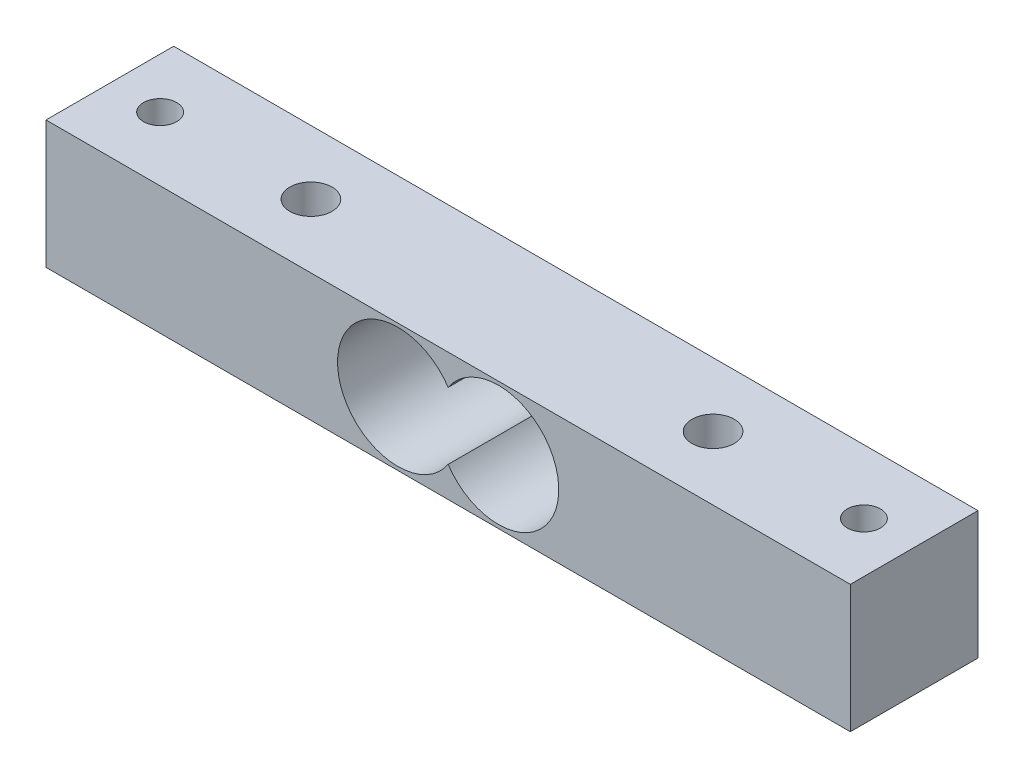
ISO-10303-21;
HEADER;
FILE_DESCRIPTION(('STEP AP214'),'2;1');
FILE_NAME('part.step','',(''),(''),'','','');
FILE_SCHEMA(('AUTOMOTIVE_DESIGN { 1 0 10303 214 1 1 1 1 }'));
ENDSEC;
DATA;
#1=APPLICATION_CONTEXT('core data for automotive mechanical design processes');
#2=APPLICATION_PROTOCOL_DEFINITION('international standard','automotive_design',2000,#1);
#3=PRODUCT_CONTEXT('',#1,'mechanical');
#4=PRODUCT('Part','Part','',(#3));
#5=PRODUCT_RELATED_PRODUCT_CATEGORY('part','',(#4));
#6=PRODUCT_DEFINITION_FORMATION('','',#4);
#7=PRODUCT_DEFINITION_CONTEXT('part definition',#1,'design');
#8=PRODUCT_DEFINITION('design','',#6,#7);
#9=PRODUCT_DEFINITION_SHAPE('','',#8);
#10=(LENGTH_UNIT() NAMED_UNIT(*) SI_UNIT(.MILLI.,.METRE.));
#11=(NAMED_UNIT(*) PLANE_ANGLE_UNIT() SI_UNIT($,.RADIAN.));
#12=(NAMED_UNIT(*) SI_UNIT($,.STERADIAN.) SOLID_ANGLE_UNIT());
#13=UNCERTAINTY_MEASURE_WITH_UNIT(LENGTH_MEASURE(1.E-05),#10,'distance_accuracy_value','');
#14=(GEOMETRIC_REPRESENTATION_CONTEXT(3) GLOBAL_UNCERTAINTY_ASSIGNED_CONTEXT((#13)) GLOBAL_UNIT_ASSIGNED_CONTEXT((#10,
#11,#12)) REPRESENTATION_CONTEXT('',''));
#15=CARTESIAN_POINT('',(0.,0.,0.));
#16=DIRECTION('',(0.,0.,1.));
#17=DIRECTION('',(1.,0.,0.));
#18=AXIS2_PLACEMENT_3D('',#15,#16,#17);
#19=CARTESIAN_POINT('',(0.,6.35,0.));
#20=DIRECTION('',(0.,-1.,0.));
#21=DIRECTION('',(0.,0.,-1.));
#22=AXIS2_PLACEMENT_3D('',#19,#20,#21);
#23=PLANE('',#22);
#24=CARTESIAN_POINT('',(-20.,6.35,0.));
#25=DIRECTION('',(0.,1.,0.));
#26=DIRECTION('',(0.,0.,1.));
#27=AXIS2_PLACEMENT_3D('',#24,#25,#26);
#28=CIRCLE('',#27,2.1);
#29=CARTESIAN_POINT('',(-20.,6.35,2.1));
#30=VERTEX_POINT('',#29);
#31=EDGE_CURVE('E273',#30,#30,#28,.T.);
#32=ORIENTED_EDGE('',*,*,#31,.F.);
#33=EDGE_LOOP('',(#32));
#34=FACE_BOUND('',#33,.T.);
#35=CARTESIAN_POINT('',(-35.,6.35,0.));
#36=DIRECTION('',(0.,1.,0.));
#37=DIRECTION('',(0.,0.,1.));
#38=AXIS2_PLACEMENT_3D('',#35,#36,#37);
#39=CIRCLE('',#38,1.65);
#40=CARTESIAN_POINT('',(-35.,6.35,1.64999999999999));
#41=VERTEX_POINT('',#40);
#42=EDGE_CURVE('E287',#41,#41,#39,.T.);
#43=ORIENTED_EDGE('',*,*,#42,.F.);
#44=EDGE_LOOP('',(#43));
#45=FACE_BOUND('',#44,.T.);
#46=DIRECTION('',(0.,0.,-1.));
#47=VECTOR('',#46,1.);
#48=CARTESIAN_POINT('',(40.,6.35,6.35));
#49=LINE('',#48,#47);
#50=CARTESIAN_POINT('',(40.,6.35,6.35));
#51=VERTEX_POINT('',#50);
#52=CARTESIAN_POINT('',(40.,6.35,-6.35));
#53=VERTEX_POINT('',#52);
#54=EDGE_CURVE('E108',#51,#53,#49,.T.);
#55=ORIENTED_EDGE('',*,*,#54,.T.);
#56=DIRECTION('',(-1.,0.,0.));
#57=VECTOR('',#56,1.);
#58=CARTESIAN_POINT('',(-40.,6.35,-6.35));
#59=LINE('',#58,#57);
#60=CARTESIAN_POINT('',(-40.,6.35,-6.35));
#61=VERTEX_POINT('',#60);
#62=EDGE_CURVE('E111',#53,#61,#59,.T.);
#63=ORIENTED_EDGE('',*,*,#62,.T.);
#64=DIRECTION('',(0.,0.,1.));
#65=VECTOR('',#64,1.);
#66=CARTESIAN_POINT('',(-40.,6.35,6.35));
#67=LINE('',#66,#65);
#68=CARTESIAN_POINT('',(-40.,6.35,6.35));
#69=VERTEX_POINT('',#68);
#70=EDGE_CURVE('E114',#61,#69,#67,.T.);
#71=ORIENTED_EDGE('',*,*,#70,.T.);
#72=DIRECTION('',(1.,0.,0.));
#73=VECTOR('',#72,1.);
#74=CARTESIAN_POINT('',(-40.,6.35,6.35));
#75=LINE('',#74,#73);
#76=EDGE_CURVE('E116',#69,#51,#75,.T.);
#77=ORIENTED_EDGE('',*,*,#76,.T.);
#78=EDGE_LOOP('',(#55,#63,#71,#77));
#79=FACE_BOUND('',#78,.T.);
#80=CARTESIAN_POINT('',(35.,6.35,0.));
#81=DIRECTION('',(0.,1.,0.));
#82=DIRECTION('',(0.,0.,1.));
#83=AXIS2_PLACEMENT_3D('',#80,#81,#82);
#84=CIRCLE('',#83,1.65);
#85=CARTESIAN_POINT('',(35.,6.35,1.64999999999999));
#86=VERTEX_POINT('',#85);
#87=EDGE_CURVE('E282',#86,#86,#84,.T.);
#88=ORIENTED_EDGE('',*,*,#87,.F.);
#89=EDGE_LOOP('',(#88));
#90=FACE_BOUND('',#89,.T.);
#91=CARTESIAN_POINT('',(20.,6.35,0.));
#92=DIRECTION('',(0.,1.,0.));
#93=DIRECTION('',(0.,0.,1.));
#94=AXIS2_PLACEMENT_3D('',#91,#92,#93);
#95=CIRCLE('',#94,2.1);
#96=CARTESIAN_POINT('',(20.,6.35,2.1));
#97=VERTEX_POINT('',#96);
#98=EDGE_CURVE('E269',#97,#97,#95,.T.);
#99=ORIENTED_EDGE('',*,*,#98,.F.);
#100=EDGE_LOOP('',(#99));
#101=FACE_BOUND('',#100,.T.);
#102=ADVANCED_FACE('F34',(#34,#45,#79,#90,#101),#23,.F.);
#103=CARTESIAN_POINT('',(40.,6.35,6.35));
#104=DIRECTION('',(-1.,0.,0.));
#105=DIRECTION('',(0.,0.,1.));
#106=AXIS2_PLACEMENT_3D('',#103,#104,#105);
#107=PLANE('',#106);
#108=DIRECTION('',(0.,0.,-1.));
#109=VECTOR('',#108,1.);
#110=CARTESIAN_POINT('',(40.,-6.35,6.35));
#111=LINE('',#110,#109);
#112=CARTESIAN_POINT('',(40.,-6.35,6.35));
#113=VERTEX_POINT('',#112);
#114=CARTESIAN_POINT('',(40.,-6.35,-6.35));
#115=VERTEX_POINT('',#114);
#116=EDGE_CURVE('E106',#113,#115,#111,.T.);
#117=ORIENTED_EDGE('',*,*,#116,.T.);
#118=DIRECTION('',(0.,-1.,0.));
#119=VECTOR('',#118,1.);
#120=CARTESIAN_POINT('',(40.,6.35,-6.35));
#121=LINE('',#120,#119);
#122=EDGE_CURVE('E11',#53,#115,#121,.T.);
#123=ORIENTED_EDGE('',*,*,#122,.F.);
#124=ORIENTED_EDGE('',*,*,#54,.F.);
#125=DIRECTION('',(0.,-1.,0.));
#126=VECTOR('',#125,1.);
#127=CARTESIAN_POINT('',(40.,6.35,6.35));
#128=LINE('',#127,#126);
#129=EDGE_CURVE('E118',#51,#113,#128,.T.);
#130=ORIENTED_EDGE('',*,*,#129,.T.);
#131=EDGE_LOOP('',(#117,#123,#124,#130));
#132=FACE_BOUND('',#131,.T.);
#133=ADVANCED_FACE('F36',(#132),#107,.F.);
#134=CARTESIAN_POINT('',(-40.,6.35,-6.35));
#135=DIRECTION('',(0.,0.,1.));
#136=DIRECTION('',(1.,0.,0.));
#137=AXIS2_PLACEMENT_3D('',#134,#135,#136);
#138=PLANE('',#137);
#139=CARTESIAN_POINT('',(5.,0.,-6.35));
#140=DIRECTION('',(0.,0.,1.));
#141=DIRECTION('',(1.,0.,0.));
#142=AXIS2_PLACEMENT_3D('',#139,#140,#141);
#143=CIRCLE('',#142,6.);
#144=CARTESIAN_POINT('',(0.,-3.3166247903554,-6.35));
#145=VERTEX_POINT('',#144);
#146=CARTESIAN_POINT('',(0.,3.3166247903554,-6.35));
#147=VERTEX_POINT('',#146);
#148=EDGE_CURVE('E90',#145,#147,#143,.T.);
#149=ORIENTED_EDGE('',*,*,#148,.T.);
#150=CARTESIAN_POINT('',(-5.,0.,-6.35));
#151=DIRECTION('',(0.,0.,1.));
#152=DIRECTION('',(1.,0.,0.));
#153=AXIS2_PLACEMENT_3D('',#150,#151,#152);
#154=CIRCLE('',#153,6.);
#155=EDGE_CURVE('E49',#147,#145,#154,.T.);
#156=ORIENTED_EDGE('',*,*,#155,.T.);
#157=EDGE_LOOP('',(#149,#156));
#158=FACE_BOUND('',#157,.T.);
#159=DIRECTION('',(-1.,0.,0.));
#160=VECTOR('',#159,1.);
#161=CARTESIAN_POINT('',(-40.,-6.35,-6.35));
#162=LINE('',#161,#160);
#163=CARTESIAN_POINT('',(-40.,-6.35,-6.35));
#164=VERTEX_POINT('',#163);
#165=EDGE_CURVE('E121',#115,#164,#162,.T.);
#166=ORIENTED_EDGE('',*,*,#165,.T.);
#167=DIRECTION('',(0.,-1.,0.));
#168=VECTOR('',#167,1.);
#169=CARTESIAN_POINT('',(-40.,6.35,-6.35));
#170=LINE('',#169,#168);
#171=EDGE_CURVE('E42',#61,#164,#170,.T.);
#172=ORIENTED_EDGE('',*,*,#171,.F.);
#173=ORIENTED_EDGE('',*,*,#62,.F.);
#174=ORIENTED_EDGE('',*,*,#122,.T.);
#175=EDGE_LOOP('',(#166,#172,#173,#174));
#176=FACE_BOUND('',#175,.T.);
#177=ADVANCED_FACE('F96',(#158,#176),#138,.F.);
#178=CARTESIAN_POINT('',(-40.,6.35,6.35));
#179=DIRECTION('',(1.,0.,0.));
#180=DIRECTION('',(0.,0.,-1.));
#181=AXIS2_PLACEMENT_3D('',#178,#179,#180);
#182=PLANE('',#181);
#183=DIRECTION('',(0.,0.,1.));
#184=VECTOR('',#183,1.);
#185=CARTESIAN_POINT('',(-40.,-6.35,6.35));
#186=LINE('',#185,#184);
#187=CARTESIAN_POINT('',(-40.,-6.35,6.35));
#188=VERTEX_POINT('',#187);
#189=EDGE_CURVE('E123',#164,#188,#186,.T.);
#190=ORIENTED_EDGE('',*,*,#189,.T.);
#191=DIRECTION('',(0.,-1.,0.));
#192=VECTOR('',#191,1.);
#193=CARTESIAN_POINT('',(-40.,6.35,6.35));
#194=LINE('',#193,#192);
#195=EDGE_CURVE('E128',#69,#188,#194,.T.);
#196=ORIENTED_EDGE('',*,*,#195,.F.);
#197=ORIENTED_EDGE('',*,*,#70,.F.);
#198=ORIENTED_EDGE('',*,*,#171,.T.);
#199=EDGE_LOOP('',(#190,#196,#197,#198));
#200=FACE_BOUND('',#199,.T.);
#201=ADVANCED_FACE('F135',(#200),#182,.F.);
#202=CARTESIAN_POINT('',(-40.,6.35,6.35));
#203=DIRECTION('',(0.,0.,-1.));
#204=DIRECTION('',(-1.,0.,0.));
#205=AXIS2_PLACEMENT_3D('',#202,#203,#204);
#206=PLANE('',#205);
#207=CARTESIAN_POINT('',(5.,0.,6.35));
#208=DIRECTION('',(0.,0.,1.));
#209=DIRECTION('',(1.,0.,0.));
#210=AXIS2_PLACEMENT_3D('',#207,#208,#209);
#211=CIRCLE('',#210,6.);
#212=CARTESIAN_POINT('',(0.,-3.3166247903554,6.35));
#213=VERTEX_POINT('',#212);
#214=CARTESIAN_POINT('',(0.,3.3166247903554,6.35));
#215=VERTEX_POINT('',#214);
#216=EDGE_CURVE('E98',#213,#215,#211,.T.);
#217=ORIENTED_EDGE('',*,*,#216,.F.);
#218=CARTESIAN_POINT('',(-5.,0.,6.35));
#219=DIRECTION('',(0.,0.,1.));
#220=DIRECTION('',(1.,0.,0.));
#221=AXIS2_PLACEMENT_3D('',#218,#219,#220);
#222=CIRCLE('',#221,6.);
#223=EDGE_CURVE('E54',#215,#213,#222,.T.);
#224=ORIENTED_EDGE('',*,*,#223,.F.);
#225=EDGE_LOOP('',(#217,#224));
#226=FACE_BOUND('',#225,.T.);
#227=DIRECTION('',(1.,0.,0.));
#228=VECTOR('',#227,1.);
#229=CARTESIAN_POINT('',(-40.,-6.35,6.35));
#230=LINE('',#229,#228);
#231=EDGE_CURVE('E112',#188,#113,#230,.T.);
#232=ORIENTED_EDGE('',*,*,#231,.T.);
#233=ORIENTED_EDGE('',*,*,#129,.F.);
#234=ORIENTED_EDGE('',*,*,#76,.F.);
#235=ORIENTED_EDGE('',*,*,#195,.T.);
#236=EDGE_LOOP('',(#232,#233,#234,#235));
#237=FACE_BOUND('',#236,.T.);
#238=ADVANCED_FACE('F143',(#226,#237),#206,.F.);
#239=CARTESIAN_POINT('',(0.,-6.35,0.));
#240=DIRECTION('',(0.,-1.,0.));
#241=DIRECTION('',(0.,0.,-1.));
#242=AXIS2_PLACEMENT_3D('',#239,#240,#241);
#243=PLANE('',#242);
#244=CARTESIAN_POINT('',(20.,-6.35,0.));
#245=DIRECTION('',(0.,-1.,0.));
#246=DIRECTION('',(0.,0.,-1.));
#247=AXIS2_PLACEMENT_3D('',#244,#245,#246);
#248=CIRCLE('',#247,2.1);
#249=CARTESIAN_POINT('',(20.,-6.35,-2.1));
#250=VERTEX_POINT('',#249);
#251=EDGE_CURVE('E272',#250,#250,#248,.T.);
#252=ORIENTED_EDGE('',*,*,#251,.F.);
#253=EDGE_LOOP('',(#252));
#254=FACE_BOUND('',#253,.T.);
#255=CARTESIAN_POINT('',(-20.,-6.35,0.));
#256=DIRECTION('',(0.,-1.,0.));
#257=DIRECTION('',(0.,0.,-1.));
#258=AXIS2_PLACEMENT_3D('',#255,#256,#257);
#259=CIRCLE('',#258,2.1);
#260=CARTESIAN_POINT('',(-20.,-6.35,-2.1));
#261=VERTEX_POINT('',#260);
#262=EDGE_CURVE('E276',#261,#261,#259,.T.);
#263=ORIENTED_EDGE('',*,*,#262,.F.);
#264=EDGE_LOOP('',(#263));
#265=FACE_BOUND('',#264,.T.);
#266=CARTESIAN_POINT('',(35.,-6.35,0.));
#267=DIRECTION('',(0.,-1.,0.));
#268=DIRECTION('',(0.,0.,-1.));
#269=AXIS2_PLACEMENT_3D('',#266,#267,#268);
#270=CIRCLE('',#269,1.65);
#271=CARTESIAN_POINT('',(35.,-6.35,-1.65000000000001));
#272=VERTEX_POINT('',#271);
#273=EDGE_CURVE('E285',#272,#272,#270,.T.);
#274=ORIENTED_EDGE('',*,*,#273,.F.);
#275=EDGE_LOOP('',(#274));
#276=FACE_BOUND('',#275,.T.);
#277=CARTESIAN_POINT('',(-35.,-6.35,0.));
#278=DIRECTION('',(0.,-1.,0.));
#279=DIRECTION('',(0.,0.,-1.));
#280=AXIS2_PLACEMENT_3D('',#277,#278,#279);
#281=CIRCLE('',#280,1.65);
#282=CARTESIAN_POINT('',(-35.,-6.35,-1.65000000000001));
#283=VERTEX_POINT('',#282);
#284=EDGE_CURVE('E102',#283,#283,#281,.T.);
#285=ORIENTED_EDGE('',*,*,#284,.F.);
#286=EDGE_LOOP('',(#285));
#287=FACE_BOUND('',#286,.T.);
#288=ORIENTED_EDGE('',*,*,#116,.F.);
#289=ORIENTED_EDGE('',*,*,#231,.F.);
#290=ORIENTED_EDGE('',*,*,#189,.F.);
#291=ORIENTED_EDGE('',*,*,#165,.F.);
#292=EDGE_LOOP('',(#288,#289,#290,#291));
#293=FACE_BOUND('',#292,.T.);
#294=ADVANCED_FACE('F140',(#254,#265,#276,#287,#293),#243,.T.);
#295=CARTESIAN_POINT('',(-5.,0.,-6.35));
#296=DIRECTION('',(0.,0.,1.));
#297=DIRECTION('',(1.,0.,0.));
#298=AXIS2_PLACEMENT_3D('',#295,#296,#297);
#299=CYLINDRICAL_SURFACE('',#298,6.);
#300=ORIENTED_EDGE('',*,*,#223,.T.);
#301=DIRECTION('',(0.,0.,1.));
#302=VECTOR('',#301,1.);
#303=CARTESIAN_POINT('',(0.,-3.3166247903554,-6.35));
#304=LINE('',#303,#302);
#305=EDGE_CURVE('E83',#145,#213,#304,.T.);
#306=ORIENTED_EDGE('',*,*,#305,.F.);
#307=ORIENTED_EDGE('',*,*,#155,.F.);
#308=DIRECTION('',(0.,0.,1.));
#309=VECTOR('',#308,1.);
#310=CARTESIAN_POINT('',(0.,3.3166247903554,-6.35));
#311=LINE('',#310,#309);
#312=EDGE_CURVE('E89',#147,#215,#311,.T.);
#313=ORIENTED_EDGE('',*,*,#312,.T.);
#314=EDGE_LOOP('',(#300,#306,#307,#313));
#315=FACE_BOUND('',#314,.T.);
#316=ADVANCED_FACE('F85',(#315),#299,.F.);
#317=CARTESIAN_POINT('',(5.,0.,-6.35));
#318=DIRECTION('',(0.,0.,1.));
#319=DIRECTION('',(1.,0.,0.));
#320=AXIS2_PLACEMENT_3D('',#317,#318,#319);
#321=CYLINDRICAL_SURFACE('',#320,6.);
#322=ORIENTED_EDGE('',*,*,#216,.T.);
#323=ORIENTED_EDGE('',*,*,#312,.F.);
#324=ORIENTED_EDGE('',*,*,#148,.F.);
#325=ORIENTED_EDGE('',*,*,#305,.T.);
#326=EDGE_LOOP('',(#322,#323,#324,#325));
#327=FACE_BOUND('',#326,.T.);
#328=ADVANCED_FACE('F93',(#327),#321,.F.);
#329=CARTESIAN_POINT('',(-35.,6.35,0.));
#330=DIRECTION('',(0.,1.,0.));
#331=DIRECTION('',(0.,0.,1.));
#332=AXIS2_PLACEMENT_3D('',#329,#330,#331);
#333=CYLINDRICAL_SURFACE('',#332,1.65);
#334=ORIENTED_EDGE('',*,*,#42,.T.);
#335=EDGE_LOOP('',(#334));
#336=FACE_BOUND('',#335,.T.);
#337=ORIENTED_EDGE('',*,*,#284,.T.);
#338=EDGE_LOOP('',(#337));
#339=FACE_BOUND('',#338,.T.);
#340=ADVANCED_FACE('F191',(#336,#339),#333,.F.);
#341=CARTESIAN_POINT('',(35.,6.35,0.));
#342=DIRECTION('',(0.,1.,0.));
#343=DIRECTION('',(0.,0.,1.));
#344=AXIS2_PLACEMENT_3D('',#341,#342,#343);
#345=CYLINDRICAL_SURFACE('',#344,1.65);
#346=ORIENTED_EDGE('',*,*,#87,.T.);
#347=EDGE_LOOP('',(#346));
#348=FACE_BOUND('',#347,.T.);
#349=ORIENTED_EDGE('',*,*,#273,.T.);
#350=EDGE_LOOP('',(#349));
#351=FACE_BOUND('',#350,.T.);
#352=ADVANCED_FACE('F198',(#348,#351),#345,.F.);
#353=CARTESIAN_POINT('',(-20.,6.35,0.));
#354=DIRECTION('',(0.,1.,0.));
#355=DIRECTION('',(0.,0.,1.));
#356=AXIS2_PLACEMENT_3D('',#353,#354,#355);
#357=CYLINDRICAL_SURFACE('',#356,2.1);
#358=ORIENTED_EDGE('',*,*,#31,.T.);
#359=EDGE_LOOP('',(#358));
#360=FACE_BOUND('',#359,.T.);
#361=ORIENTED_EDGE('',*,*,#262,.T.);
#362=EDGE_LOOP('',(#361));
#363=FACE_BOUND('',#362,.T.);
#364=ADVANCED_FACE('F206',(#360,#363),#357,.F.);
#365=CARTESIAN_POINT('',(20.,6.35,0.));
#366=DIRECTION('',(0.,1.,0.));
#367=DIRECTION('',(0.,0.,1.));
#368=AXIS2_PLACEMENT_3D('',#365,#366,#367);
#369=CYLINDRICAL_SURFACE('',#368,2.1);
#370=ORIENTED_EDGE('',*,*,#98,.T.);
#371=EDGE_LOOP('',(#370));
#372=FACE_BOUND('',#371,.T.);
#373=ORIENTED_EDGE('',*,*,#251,.T.);
#374=EDGE_LOOP('',(#373));
#375=FACE_BOUND('',#374,.T.);
#376=ADVANCED_FACE('F215',(#372,#375),#369,.F.);
#377=CLOSED_SHELL('',(#102,#133,#177,#201,#238,#294,#316,#328,#340,#352,#364,#376));
#378=MANIFOLD_SOLID_BREP('B2',#377);
#379=ADVANCED_BREP_SHAPE_REPRESENTATION('',(#18,#378),#14);
#380=SHAPE_DEFINITION_REPRESENTATION(#9,#379);
ENDSEC;
END-ISO-10303-21;
